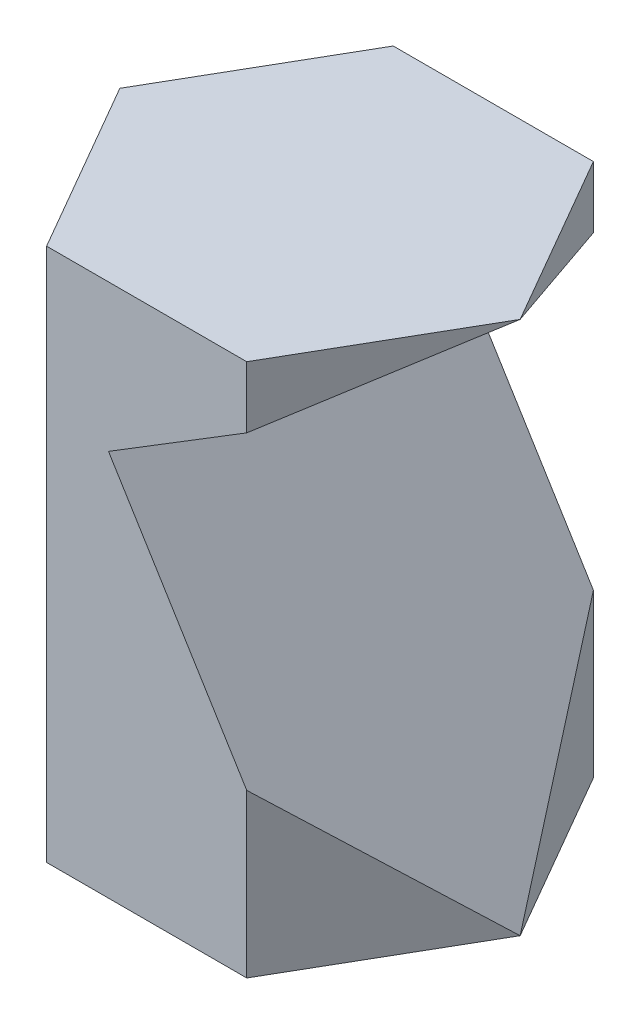
ISO-10303-21;
HEADER;
FILE_DESCRIPTION(('STEP AP214'),'2;1');
FILE_NAME('part.step','',(''),(''),'','','');
FILE_SCHEMA(('AUTOMOTIVE_DESIGN { 1 0 10303 214 1 1 1 1 }'));
ENDSEC;
DATA;
#1=APPLICATION_CONTEXT('core data for automotive mechanical design processes');
#2=APPLICATION_PROTOCOL_DEFINITION('international standard','automotive_design',2000,#1);
#3=PRODUCT_CONTEXT('',#1,'mechanical');
#4=PRODUCT('Part','Part','',(#3));
#5=PRODUCT_RELATED_PRODUCT_CATEGORY('part','',(#4));
#6=PRODUCT_DEFINITION_FORMATION('','',#4);
#7=PRODUCT_DEFINITION_CONTEXT('part definition',#1,'design');
#8=PRODUCT_DEFINITION('design','',#6,#7);
#9=PRODUCT_DEFINITION_SHAPE('','',#8);
#10=(LENGTH_UNIT() NAMED_UNIT(*) SI_UNIT(.MILLI.,.METRE.));
#11=(NAMED_UNIT(*) PLANE_ANGLE_UNIT() SI_UNIT($,.RADIAN.));
#12=(NAMED_UNIT(*) SI_UNIT($,.STERADIAN.) SOLID_ANGLE_UNIT());
#13=UNCERTAINTY_MEASURE_WITH_UNIT(LENGTH_MEASURE(1.E-05),#10,'distance_accuracy_value','');
#14=(GEOMETRIC_REPRESENTATION_CONTEXT(3) GLOBAL_UNCERTAINTY_ASSIGNED_CONTEXT((#13)) GLOBAL_UNIT_ASSIGNED_CONTEXT((#10,
#11,#12)) REPRESENTATION_CONTEXT('',''));
#15=CARTESIAN_POINT('',(0.,0.,0.));
#16=DIRECTION('',(0.,0.,1.));
#17=DIRECTION('',(1.,0.,0.));
#18=AXIS2_PLACEMENT_3D('',#15,#16,#17);
#19=CARTESIAN_POINT('',(15.,80.,61.9615242270663));
#20=DIRECTION('',(0.,0.,-1.));
#21=DIRECTION('',(-1.,0.,0.));
#22=AXIS2_PLACEMENT_3D('',#19,#20,#21);
#23=PLANE('',#22);
#24=DIRECTION('',(-0.85146931829632,-0.524404424085076,0.));
#25=VECTOR('',#24,1.);
#26=CARTESIAN_POINT('',(60.,80.,61.9615242270663));
#27=LINE('',#26,#25);
#28=CARTESIAN_POINT('',(45.,70.7617735692284,61.9615242270663));
#29=VERTEX_POINT('',#28);
#30=CARTESIAN_POINT('',(24.2788578010165,58.,61.9615242270663));
#31=VERTEX_POINT('',#30);
#32=EDGE_CURVE('E177',#29,#31,#27,.T.);
#33=ORIENTED_EDGE('',*,*,#32,.F.);
#34=DIRECTION('',(0.,-1.,0.));
#35=VECTOR('',#34,1.);
#36=CARTESIAN_POINT('',(45.,80.,61.9615242270663));
#37=LINE('',#36,#35);
#38=CARTESIAN_POINT('',(45.,80.,61.9615242270663));
#39=VERTEX_POINT('',#38);
#40=EDGE_CURVE('E11',#39,#29,#37,.T.);
#41=ORIENTED_EDGE('',*,*,#40,.F.);
#42=DIRECTION('',(1.,0.,0.));
#43=VECTOR('',#42,1.);
#44=CARTESIAN_POINT('',(15.,80.,61.9615242270663));
#45=LINE('',#44,#43);
#46=CARTESIAN_POINT('',(15.,80.,61.9615242270663));
#47=VERTEX_POINT('',#46);
#48=EDGE_CURVE('E138',#47,#39,#45,.T.);
#49=ORIENTED_EDGE('',*,*,#48,.F.);
#50=DIRECTION('',(0.,-1.,0.));
#51=VECTOR('',#50,1.);
#52=CARTESIAN_POINT('',(15.,80.,61.9615242270663));
#53=LINE('',#52,#51);
#54=CARTESIAN_POINT('',(15.,0.,61.9615242270663));
#55=VERTEX_POINT('',#54);
#56=EDGE_CURVE('E120',#47,#55,#53,.T.);
#57=ORIENTED_EDGE('',*,*,#56,.T.);
#58=DIRECTION('',(1.,0.,0.));
#59=VECTOR('',#58,1.);
#60=CARTESIAN_POINT('',(15.,0.,61.9615242270663));
#61=LINE('',#60,#59);
#62=CARTESIAN_POINT('',(45.,0.,61.9615242270663));
#63=VERTEX_POINT('',#62);
#64=EDGE_CURVE('E124',#55,#63,#61,.T.);
#65=ORIENTED_EDGE('',*,*,#64,.T.);
#66=CARTESIAN_POINT('',(45.,24.3553242265796,61.9615242270663));
#67=VERTEX_POINT('',#66);
#68=EDGE_CURVE('E40',#67,#63,#37,.T.);
#69=ORIENTED_EDGE('',*,*,#68,.F.);
#70=DIRECTION('',(0.524404424085076,-0.85146931829632,0.));
#71=VECTOR('',#70,1.);
#72=CARTESIAN_POINT('',(24.2788578010165,58.,61.9615242270663));
#73=LINE('',#72,#71);
#74=EDGE_CURVE('E174',#31,#67,#73,.T.);
#75=ORIENTED_EDGE('',*,*,#74,.F.);
#76=EDGE_LOOP('',(#33,#41,#49,#57,#65,#69,#75));
#77=FACE_BOUND('',#76,.T.);
#78=ADVANCED_FACE('F33',(#77),#23,.F.);
#79=CARTESIAN_POINT('',(45.,80.,61.9615242270663));
#80=DIRECTION('',(-0.866025403784439,0.,-0.5));
#81=DIRECTION('',(-0.5,0.,0.866025403784439));
#82=AXIS2_PLACEMENT_3D('',#79,#80,#81);
#83=PLANE('',#82);
#84=DIRECTION('',(-0.477856104588937,-0.294302859701272,0.827671051854987));
#85=VECTOR('',#84,1.);
#86=CARTESIAN_POINT('',(46.2992125984252,71.561934913626,59.7112219967603));
#87=LINE('',#86,#85);
#88=CARTESIAN_POINT('',(60.,80.,35.9807621135331));
#89=VERTEX_POINT('',#88);
#90=EDGE_CURVE('E128',#89,#29,#87,.T.);
#91=ORIENTED_EDGE('',*,*,#90,.F.);
#92=DIRECTION('',(0.5,0.,-0.866025403784439));
#93=VECTOR('',#92,1.);
#94=CARTESIAN_POINT('',(45.,80.,61.9615242270663));
#95=LINE('',#94,#93);
#96=EDGE_CURVE('E88',#39,#89,#95,.T.);
#97=ORIENTED_EDGE('',*,*,#96,.F.);
#98=ORIENTED_EDGE('',*,*,#40,.T.);
#99=EDGE_LOOP('',(#91,#97,#98));
#100=FACE_BOUND('',#99,.T.);
#101=ADVANCED_FACE('F207',(#100),#83,.F.);
#102=DIRECTION('',(0.388181570282322,-0.630285866867251,-0.672350202290851));
#103=VECTOR('',#102,1.);
#104=CARTESIAN_POINT('',(31.3856755074063,46.4607433694452,85.542225958968));
#105=LINE('',#104,#103);
#106=CARTESIAN_POINT('',(60.,0.,35.9807621135332));
#107=VERTEX_POINT('',#106);
#108=EDGE_CURVE('E167',#67,#107,#105,.T.);
#109=ORIENTED_EDGE('',*,*,#108,.F.);
#110=ORIENTED_EDGE('',*,*,#68,.T.);
#111=DIRECTION('',(0.5,0.,-0.866025403784439));
#112=VECTOR('',#111,1.);
#113=CARTESIAN_POINT('',(45.,0.,61.9615242270663));
#114=LINE('',#113,#112);
#115=EDGE_CURVE('E127',#63,#107,#114,.T.);
#116=ORIENTED_EDGE('',*,*,#115,.T.);
#117=EDGE_LOOP('',(#109,#110,#116));
#118=FACE_BOUND('',#117,.T.);
#119=ADVANCED_FACE('F193',(#118),#83,.F.);
#120=CARTESIAN_POINT('',(60.,80.,35.9807621135331));
#121=DIRECTION('',(-0.866025403784438,0.,0.5));
#122=DIRECTION('',(0.5,0.,0.866025403784439));
#123=AXIS2_PLACEMENT_3D('',#120,#121,#122);
#124=PLANE('',#123);
#125=DIRECTION('',(0.477856104588938,0.294302859701272,0.827671051854987));
#126=VECTOR('',#125,1.);
#127=CARTESIAN_POINT('',(60.,80.,35.9807621135331));
#128=LINE('',#127,#126);
#129=CARTESIAN_POINT('',(45.,70.7617735692284,9.99999999999999));
#130=VERTEX_POINT('',#129);
#131=EDGE_CURVE('E161',#130,#89,#128,.T.);
#132=ORIENTED_EDGE('',*,*,#131,.F.);
#133=DIRECTION('',(0.,-1.,0.));
#134=VECTOR('',#133,1.);
#135=CARTESIAN_POINT('',(45.,80.,9.99999999999999));
#136=LINE('',#135,#134);
#137=CARTESIAN_POINT('',(45.,80.,9.99999999999999));
#138=VERTEX_POINT('',#137);
#139=EDGE_CURVE('E140',#138,#130,#136,.T.);
#140=ORIENTED_EDGE('',*,*,#139,.F.);
#141=DIRECTION('',(-0.5,0.,-0.866025403784438));
#142=VECTOR('',#141,1.);
#143=CARTESIAN_POINT('',(60.,80.,35.9807621135331));
#144=LINE('',#143,#142);
#145=EDGE_CURVE('E102',#89,#138,#144,.T.);
#146=ORIENTED_EDGE('',*,*,#145,.F.);
#147=EDGE_LOOP('',(#132,#140,#146));
#148=FACE_BOUND('',#147,.T.);
#149=ADVANCED_FACE('F200',(#148),#124,.F.);
#150=DIRECTION('',(-0.388181570282322,0.630285866867252,-0.672350202290851));
#151=VECTOR('',#150,1.);
#152=CARTESIAN_POINT('',(40.4267713978172,31.7808219178082,2.0789357063923));
#153=LINE('',#152,#151);
#154=CARTESIAN_POINT('',(45.,24.3553242265797,9.99999999999999));
#155=VERTEX_POINT('',#154);
#156=EDGE_CURVE('E47',#107,#155,#153,.T.);
#157=ORIENTED_EDGE('',*,*,#156,.F.);
#158=DIRECTION('',(-0.5,0.,-0.866025403784438));
#159=VECTOR('',#158,1.);
#160=CARTESIAN_POINT('',(60.,0.,35.9807621135331));
#161=LINE('',#160,#159);
#162=CARTESIAN_POINT('',(45.,0.,9.99999999999999));
#163=VERTEX_POINT('',#162);
#164=EDGE_CURVE('E131',#107,#163,#161,.T.);
#165=ORIENTED_EDGE('',*,*,#164,.T.);
#166=EDGE_CURVE('E115',#155,#163,#136,.T.);
#167=ORIENTED_EDGE('',*,*,#166,.F.);
#168=EDGE_LOOP('',(#157,#165,#167));
#169=FACE_BOUND('',#168,.T.);
#170=ADVANCED_FACE('F145',(#169),#124,.F.);
#171=CARTESIAN_POINT('',(45.,80.,9.99999999999999));
#172=DIRECTION('',(0.,0.,1.));
#173=DIRECTION('',(1.,0.,0.));
#174=AXIS2_PLACEMENT_3D('',#171,#172,#173);
#175=PLANE('',#174);
#176=DIRECTION('',(0.85146931829632,0.524404424085076,0.));
#177=VECTOR('',#176,1.);
#178=CARTESIAN_POINT('',(49.125,73.3022858376906,9.99999999999999));
#179=LINE('',#178,#177);
#180=CARTESIAN_POINT('',(24.2788578010165,58.,9.99999999999999));
#181=VERTEX_POINT('',#180);
#182=EDGE_CURVE('E164',#181,#130,#179,.T.);
#183=ORIENTED_EDGE('',*,*,#182,.F.);
#184=DIRECTION('',(-0.524404424085076,0.85146931829632,0.));
#185=VECTOR('',#184,1.);
#186=CARTESIAN_POINT('',(20.1538578010165,64.6977141623094,10.));
#187=LINE('',#186,#185);
#188=EDGE_CURVE('E142',#155,#181,#187,.T.);
#189=ORIENTED_EDGE('',*,*,#188,.F.);
#190=ORIENTED_EDGE('',*,*,#166,.T.);
#191=DIRECTION('',(-1.,0.,0.));
#192=VECTOR('',#191,1.);
#193=CARTESIAN_POINT('',(45.,0.,9.99999999999999));
#194=LINE('',#193,#192);
#195=CARTESIAN_POINT('',(15.,0.,10.));
#196=VERTEX_POINT('',#195);
#197=EDGE_CURVE('E112',#163,#196,#194,.T.);
#198=ORIENTED_EDGE('',*,*,#197,.T.);
#199=DIRECTION('',(0.,-1.,0.));
#200=VECTOR('',#199,1.);
#201=CARTESIAN_POINT('',(15.,80.,10.));
#202=LINE('',#201,#200);
#203=CARTESIAN_POINT('',(15.,80.,10.));
#204=VERTEX_POINT('',#203);
#205=EDGE_CURVE('E108',#204,#196,#202,.T.);
#206=ORIENTED_EDGE('',*,*,#205,.F.);
#207=DIRECTION('',(-1.,0.,0.));
#208=VECTOR('',#207,1.);
#209=CARTESIAN_POINT('',(45.,80.,9.99999999999999));
#210=LINE('',#209,#208);
#211=EDGE_CURVE('E95',#138,#204,#210,.T.);
#212=ORIENTED_EDGE('',*,*,#211,.F.);
#213=ORIENTED_EDGE('',*,*,#139,.T.);
#214=EDGE_LOOP('',(#183,#189,#190,#198,#206,#212,#213));
#215=FACE_BOUND('',#214,.T.);
#216=ADVANCED_FACE('F110',(#215),#175,.F.);
#217=CARTESIAN_POINT('',(15.,80.,10.));
#218=DIRECTION('',(0.866025403784438,0.,0.5));
#219=DIRECTION('',(0.5,0.,-0.866025403784438));
#220=AXIS2_PLACEMENT_3D('',#217,#218,#219);
#221=PLANE('',#220);
#222=DIRECTION('',(-0.5,0.,0.866025403784438));
#223=VECTOR('',#222,1.);
#224=CARTESIAN_POINT('',(15.,0.,10.));
#225=LINE('',#224,#223);
#226=CARTESIAN_POINT('',(0.,0.,35.9807621135332));
#227=VERTEX_POINT('',#226);
#228=EDGE_CURVE('E135',#196,#227,#225,.T.);
#229=ORIENTED_EDGE('',*,*,#228,.T.);
#230=DIRECTION('',(0.,-1.,0.));
#231=VECTOR('',#230,1.);
#232=CARTESIAN_POINT('',(0.,80.,35.9807621135332));
#233=LINE('',#232,#231);
#234=CARTESIAN_POINT('',(0.,80.,35.9807621135332));
#235=VERTEX_POINT('',#234);
#236=EDGE_CURVE('E116',#235,#227,#233,.T.);
#237=ORIENTED_EDGE('',*,*,#236,.F.);
#238=DIRECTION('',(-0.5,0.,0.866025403784438));
#239=VECTOR('',#238,1.);
#240=CARTESIAN_POINT('',(15.,80.,10.));
#241=LINE('',#240,#239);
#242=EDGE_CURVE('E99',#204,#235,#241,.T.);
#243=ORIENTED_EDGE('',*,*,#242,.F.);
#244=ORIENTED_EDGE('',*,*,#205,.T.);
#245=EDGE_LOOP('',(#229,#237,#243,#244));
#246=FACE_BOUND('',#245,.T.);
#247=ADVANCED_FACE('F118',(#246),#221,.F.);
#248=CARTESIAN_POINT('',(0.,80.,35.9807621135332));
#249=DIRECTION('',(0.866025403784438,0.,-0.5));
#250=DIRECTION('',(-0.5,0.,-0.866025403784438));
#251=AXIS2_PLACEMENT_3D('',#248,#249,#250);
#252=PLANE('',#251);
#253=DIRECTION('',(0.5,0.,0.866025403784438));
#254=VECTOR('',#253,1.);
#255=CARTESIAN_POINT('',(0.,0.,35.9807621135332));
#256=LINE('',#255,#254);
#257=EDGE_CURVE('E80',#227,#55,#256,.T.);
#258=ORIENTED_EDGE('',*,*,#257,.T.);
#259=ORIENTED_EDGE('',*,*,#56,.F.);
#260=DIRECTION('',(0.5,0.,0.866025403784438));
#261=VECTOR('',#260,1.);
#262=CARTESIAN_POINT('',(0.,80.,35.9807621135332));
#263=LINE('',#262,#261);
#264=EDGE_CURVE('E56',#235,#47,#263,.T.);
#265=ORIENTED_EDGE('',*,*,#264,.F.);
#266=ORIENTED_EDGE('',*,*,#236,.T.);
#267=EDGE_LOOP('',(#258,#259,#265,#266));
#268=FACE_BOUND('',#267,.T.);
#269=ADVANCED_FACE('F151',(#268),#252,.F.);
#270=CARTESIAN_POINT('',(0.,80.,0.));
#271=DIRECTION('',(0.,1.,0.));
#272=DIRECTION('',(0.,0.,1.));
#273=AXIS2_PLACEMENT_3D('',#270,#271,#272);
#274=PLANE('',#273);
#275=ORIENTED_EDGE('',*,*,#48,.T.);
#276=ORIENTED_EDGE('',*,*,#96,.T.);
#277=ORIENTED_EDGE('',*,*,#145,.T.);
#278=ORIENTED_EDGE('',*,*,#211,.T.);
#279=ORIENTED_EDGE('',*,*,#242,.T.);
#280=ORIENTED_EDGE('',*,*,#264,.T.);
#281=EDGE_LOOP('',(#275,#276,#277,#278,#279,#280));
#282=FACE_BOUND('',#281,.T.);
#283=ADVANCED_FACE('F97',(#282),#274,.T.);
#284=CARTESIAN_POINT('',(0.,0.,0.));
#285=DIRECTION('',(0.,1.,0.));
#286=DIRECTION('',(0.,0.,1.));
#287=AXIS2_PLACEMENT_3D('',#284,#285,#286);
#288=PLANE('',#287);
#289=ORIENTED_EDGE('',*,*,#64,.F.);
#290=ORIENTED_EDGE('',*,*,#257,.F.);
#291=ORIENTED_EDGE('',*,*,#228,.F.);
#292=ORIENTED_EDGE('',*,*,#197,.F.);
#293=ORIENTED_EDGE('',*,*,#164,.F.);
#294=ORIENTED_EDGE('',*,*,#115,.F.);
#295=EDGE_LOOP('',(#289,#290,#291,#292,#293,#294));
#296=FACE_BOUND('',#295,.T.);
#297=ADVANCED_FACE('F150',(#296),#288,.F.);
#298=CARTESIAN_POINT('',(60.,80.,61.9615242270663));
#299=DIRECTION('',(0.524404424085076,-0.85146931829632,0.));
#300=DIRECTION('',(0.85146931829632,0.524404424085076,0.));
#301=AXIS2_PLACEMENT_3D('',#298,#299,#300);
#302=PLANE('',#301);
#303=ORIENTED_EDGE('',*,*,#90,.T.);
#304=ORIENTED_EDGE('',*,*,#32,.T.);
#305=DIRECTION('',(0.,0.,-1.));
#306=VECTOR('',#305,1.);
#307=CARTESIAN_POINT('',(24.2788578010165,58.,61.9615242270663));
#308=LINE('',#307,#306);
#309=EDGE_CURVE('E171',#31,#181,#308,.T.);
#310=ORIENTED_EDGE('',*,*,#309,.T.);
#311=ORIENTED_EDGE('',*,*,#182,.T.);
#312=ORIENTED_EDGE('',*,*,#131,.T.);
#313=EDGE_LOOP('',(#303,#304,#310,#311,#312));
#314=FACE_BOUND('',#313,.T.);
#315=ADVANCED_FACE('F182',(#314),#302,.T.);
#316=CARTESIAN_POINT('',(24.2788578010165,58.,61.9615242270663));
#317=DIRECTION('',(0.85146931829632,0.524404424085076,0.));
#318=DIRECTION('',(-0.524404424085076,0.85146931829632,0.));
#319=AXIS2_PLACEMENT_3D('',#316,#317,#318);
#320=PLANE('',#319);
#321=ORIENTED_EDGE('',*,*,#108,.T.);
#322=ORIENTED_EDGE('',*,*,#156,.T.);
#323=ORIENTED_EDGE('',*,*,#188,.T.);
#324=ORIENTED_EDGE('',*,*,#309,.F.);
#325=ORIENTED_EDGE('',*,*,#74,.T.);
#326=EDGE_LOOP('',(#321,#322,#323,#324,#325));
#327=FACE_BOUND('',#326,.T.);
#328=ADVANCED_FACE('F187',(#327),#320,.T.);
#329=CLOSED_SHELL('',(#78,#101,#119,#149,#170,#216,#247,#269,#283,#297,#315,#328));
#330=MANIFOLD_SOLID_BREP('B2',#329);
#331=ADVANCED_BREP_SHAPE_REPRESENTATION('',(#18,#330),#14);
#332=SHAPE_DEFINITION_REPRESENTATION(#9,#331);
ENDSEC;
END-ISO-10303-21;
